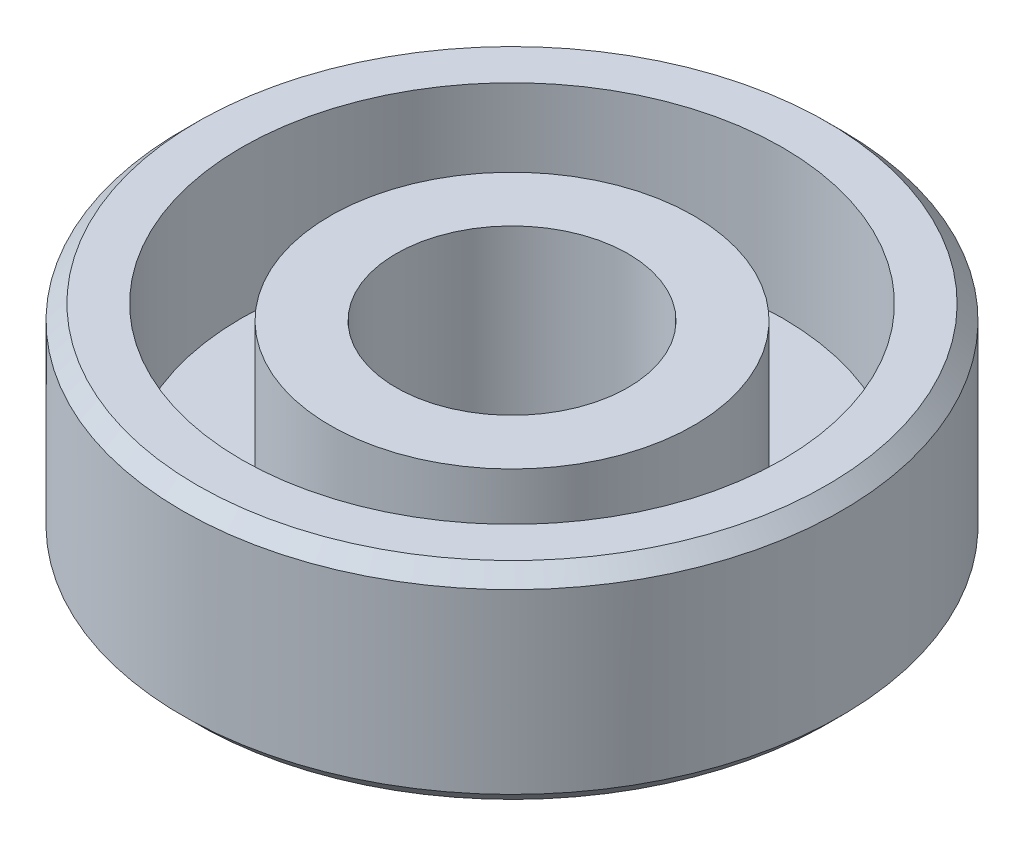
ISO-10303-21;
HEADER;
FILE_DESCRIPTION(('STEP AP214'),'2;1');
FILE_NAME('part.step','',(''),(''),'','','');
FILE_SCHEMA(('AUTOMOTIVE_DESIGN { 1 0 10303 214 1 1 1 1 }'));
ENDSEC;
DATA;
#1=APPLICATION_CONTEXT('core data for automotive mechanical design processes');
#2=APPLICATION_PROTOCOL_DEFINITION('international standard','automotive_design',2000,#1);
#3=PRODUCT_CONTEXT('',#1,'mechanical');
#4=PRODUCT('Part','Part','',(#3));
#5=PRODUCT_RELATED_PRODUCT_CATEGORY('part','',(#4));
#6=PRODUCT_DEFINITION_FORMATION('','',#4);
#7=PRODUCT_DEFINITION_CONTEXT('part definition',#1,'design');
#8=PRODUCT_DEFINITION('design','',#6,#7);
#9=PRODUCT_DEFINITION_SHAPE('','',#8);
#10=(LENGTH_UNIT() NAMED_UNIT(*) SI_UNIT(.MILLI.,.METRE.));
#11=(NAMED_UNIT(*) PLANE_ANGLE_UNIT() SI_UNIT($,.RADIAN.));
#12=(NAMED_UNIT(*) SI_UNIT($,.STERADIAN.) SOLID_ANGLE_UNIT());
#13=UNCERTAINTY_MEASURE_WITH_UNIT(LENGTH_MEASURE(1.E-05),#10,'distance_accuracy_value','');
#14=(GEOMETRIC_REPRESENTATION_CONTEXT(3) GLOBAL_UNCERTAINTY_ASSIGNED_CONTEXT((#13)) GLOBAL_UNIT_ASSIGNED_CONTEXT((#10,
#11,#12)) REPRESENTATION_CONTEXT('',''));
#15=CARTESIAN_POINT('',(0.,0.,0.));
#16=DIRECTION('',(0.,0.,1.));
#17=DIRECTION('',(1.,0.,0.));
#18=AXIS2_PLACEMENT_3D('',#15,#16,#17);
#19=CARTESIAN_POINT('',(0.,0.,0.));
#20=DIRECTION('',(0.,-1.,0.));
#21=DIRECTION('',(0.,0.,-1.));
#22=AXIS2_PLACEMENT_3D('',#19,#20,#21);
#23=CYLINDRICAL_SURFACE('',#22,3.925);
#24=CARTESIAN_POINT('',(0.,11.0925223970787,0.));
#25=DIRECTION('',(0.,-1.,0.));
#26=DIRECTION('',(0.,0.,-1.));
#27=AXIS2_PLACEMENT_3D('',#24,#25,#26);
#28=CIRCLE('',#27,3.925);
#29=CARTESIAN_POINT('',(0.,11.0925223970787,-3.925));
#30=VERTEX_POINT('',#29);
#31=EDGE_CURVE('E51',#30,#30,#28,.T.);
#32=ORIENTED_EDGE('',*,*,#31,.T.);
#33=EDGE_LOOP('',(#32));
#34=FACE_BOUND('',#33,.T.);
#35=CARTESIAN_POINT('',(0.,17.5925223970787,0.));
#36=DIRECTION('',(0.,-1.,0.));
#37=DIRECTION('',(0.,0.,-1.));
#38=AXIS2_PLACEMENT_3D('',#35,#36,#37);
#39=CIRCLE('',#38,3.925);
#40=CARTESIAN_POINT('',(0.,17.5925223970787,-3.925));
#41=VERTEX_POINT('',#40);
#42=EDGE_CURVE('E66',#41,#41,#39,.T.);
#43=ORIENTED_EDGE('',*,*,#42,.F.);
#44=EDGE_LOOP('',(#43));
#45=FACE_BOUND('',#44,.T.);
#46=ADVANCED_FACE('F31',(#34,#45),#23,.F.);
#47=CARTESIAN_POINT('',(9.66281728302333,11.0925223970787,0.));
#48=DIRECTION('',(0.,-1.,0.));
#49=DIRECTION('',(0.,0.,-1.));
#50=AXIS2_PLACEMENT_3D('',#47,#48,#49);
#51=PLANE('',#50);
#52=CARTESIAN_POINT('',(0.,11.0925223970787,0.));
#53=DIRECTION('',(0.,-1.,0.));
#54=DIRECTION('',(0.,0.,-1.));
#55=AXIS2_PLACEMENT_3D('',#52,#53,#54);
#56=CIRCLE('',#55,10.65);
#57=CARTESIAN_POINT('',(0.,11.0925223970787,-10.65));
#58=VERTEX_POINT('',#57);
#59=EDGE_CURVE('E46',#58,#58,#56,.T.);
#60=ORIENTED_EDGE('',*,*,#59,.T.);
#61=EDGE_LOOP('',(#60));
#62=FACE_BOUND('',#61,.T.);
#63=ORIENTED_EDGE('',*,*,#31,.F.);
#64=EDGE_LOOP('',(#63));
#65=FACE_BOUND('',#64,.T.);
#66=ADVANCED_FACE('F74',(#62,#65),#51,.T.);
#67=CARTESIAN_POINT('',(0.,0.,0.));
#68=DIRECTION('',(0.,-1.,0.));
#69=DIRECTION('',(0.,0.,-1.));
#70=AXIS2_PLACEMENT_3D('',#67,#68,#69);
#71=CYLINDRICAL_SURFACE('',#70,11.15);
#72=CARTESIAN_POINT('',(0.,11.5925223970787,0.));
#73=DIRECTION('',(0.,-1.,0.));
#74=DIRECTION('',(0.,0.,-1.));
#75=AXIS2_PLACEMENT_3D('',#72,#73,#74);
#76=CIRCLE('',#75,11.15);
#77=CARTESIAN_POINT('',(0.,11.5925223970787,-11.15));
#78=VERTEX_POINT('',#77);
#79=EDGE_CURVE('E38',#78,#78,#76,.F.);
#80=ORIENTED_EDGE('',*,*,#79,.T.);
#81=EDGE_LOOP('',(#80));
#82=FACE_BOUND('',#81,.T.);
#83=CARTESIAN_POINT('',(0.,17.5925223970787,0.));
#84=DIRECTION('',(0.,1.,0.));
#85=DIRECTION('',(0.,0.,1.));
#86=AXIS2_PLACEMENT_3D('',#83,#84,#85);
#87=CIRCLE('',#86,11.15);
#88=CARTESIAN_POINT('',(0.,17.5925223970787,11.15));
#89=VERTEX_POINT('',#88);
#90=EDGE_CURVE('E42',#89,#89,#87,.F.);
#91=ORIENTED_EDGE('',*,*,#90,.T.);
#92=EDGE_LOOP('',(#91));
#93=FACE_BOUND('',#92,.T.);
#94=ADVANCED_FACE('F80',(#82,#93),#71,.T.);
#95=CARTESIAN_POINT('',(9.15,18.0925223970787,0.));
#96=DIRECTION('',(0.,1.,0.));
#97=DIRECTION('',(0.,0.,1.));
#98=AXIS2_PLACEMENT_3D('',#95,#96,#97);
#99=PLANE('',#98);
#100=CARTESIAN_POINT('',(0.,18.0925223970787,0.));
#101=DIRECTION('',(0.,1.,0.));
#102=DIRECTION('',(0.,0.,1.));
#103=AXIS2_PLACEMENT_3D('',#100,#101,#102);
#104=CIRCLE('',#103,10.65);
#105=CARTESIAN_POINT('',(0.,18.0925223970787,10.65));
#106=VERTEX_POINT('',#105);
#107=EDGE_CURVE('E10',#106,#106,#104,.T.);
#108=ORIENTED_EDGE('',*,*,#107,.T.);
#109=EDGE_LOOP('',(#108));
#110=FACE_BOUND('',#109,.T.);
#111=CARTESIAN_POINT('',(0.,18.0925223970787,0.));
#112=DIRECTION('',(0.,-1.,0.));
#113=DIRECTION('',(0.,0.,-1.));
#114=AXIS2_PLACEMENT_3D('',#111,#112,#113);
#115=CIRCLE('',#114,9.15);
#116=CARTESIAN_POINT('',(0.,18.0925223970787,-9.15));
#117=VERTEX_POINT('',#116);
#118=EDGE_CURVE('E54',#117,#117,#115,.T.);
#119=ORIENTED_EDGE('',*,*,#118,.T.);
#120=EDGE_LOOP('',(#119));
#121=FACE_BOUND('',#120,.T.);
#122=ADVANCED_FACE('F111',(#110,#121),#99,.T.);
#123=CARTESIAN_POINT('',(0.,0.,0.));
#124=DIRECTION('',(0.,-1.,0.));
#125=DIRECTION('',(0.,0.,-1.));
#126=AXIS2_PLACEMENT_3D('',#123,#124,#125);
#127=CYLINDRICAL_SURFACE('',#126,9.15);
#128=CARTESIAN_POINT('',(0.,13.0925223970787,0.));
#129=DIRECTION('',(0.,-1.,0.));
#130=DIRECTION('',(0.,0.,-1.));
#131=AXIS2_PLACEMENT_3D('',#128,#129,#130);
#132=CIRCLE('',#131,9.15);
#133=CARTESIAN_POINT('',(0.,13.0925223970787,-9.15));
#134=VERTEX_POINT('',#133);
#135=EDGE_CURVE('E57',#134,#134,#132,.T.);
#136=ORIENTED_EDGE('',*,*,#135,.T.);
#137=EDGE_LOOP('',(#136));
#138=FACE_BOUND('',#137,.T.);
#139=ORIENTED_EDGE('',*,*,#118,.F.);
#140=EDGE_LOOP('',(#139));
#141=FACE_BOUND('',#140,.T.);
#142=ADVANCED_FACE('F107',(#138,#141),#127,.F.);
#143=CARTESIAN_POINT('',(6.15,13.0925223970787,0.));
#144=DIRECTION('',(0.,1.,0.));
#145=DIRECTION('',(0.,0.,1.));
#146=AXIS2_PLACEMENT_3D('',#143,#144,#145);
#147=PLANE('',#146);
#148=CARTESIAN_POINT('',(0.,13.0925223970787,0.));
#149=DIRECTION('',(0.,-1.,0.));
#150=DIRECTION('',(0.,0.,-1.));
#151=AXIS2_PLACEMENT_3D('',#148,#149,#150);
#152=CIRCLE('',#151,6.15);
#153=CARTESIAN_POINT('',(0.,13.0925223970787,-6.15));
#154=VERTEX_POINT('',#153);
#155=EDGE_CURVE('E60',#154,#154,#152,.T.);
#156=ORIENTED_EDGE('',*,*,#155,.T.);
#157=EDGE_LOOP('',(#156));
#158=FACE_BOUND('',#157,.T.);
#159=ORIENTED_EDGE('',*,*,#135,.F.);
#160=EDGE_LOOP('',(#159));
#161=FACE_BOUND('',#160,.T.);
#162=ADVANCED_FACE('F101',(#158,#161),#147,.T.);
#163=CARTESIAN_POINT('',(0.,0.,0.));
#164=DIRECTION('',(0.,-1.,0.));
#165=DIRECTION('',(0.,0.,-1.));
#166=AXIS2_PLACEMENT_3D('',#163,#164,#165);
#167=CYLINDRICAL_SURFACE('',#166,6.15);
#168=CARTESIAN_POINT('',(0.,17.5925223970787,0.));
#169=DIRECTION('',(0.,-1.,0.));
#170=DIRECTION('',(0.,0.,-1.));
#171=AXIS2_PLACEMENT_3D('',#168,#169,#170);
#172=CIRCLE('',#171,6.15);
#173=CARTESIAN_POINT('',(0.,17.5925223970787,-6.15));
#174=VERTEX_POINT('',#173);
#175=EDGE_CURVE('E63',#174,#174,#172,.T.);
#176=ORIENTED_EDGE('',*,*,#175,.T.);
#177=EDGE_LOOP('',(#176));
#178=FACE_BOUND('',#177,.T.);
#179=ORIENTED_EDGE('',*,*,#155,.F.);
#180=EDGE_LOOP('',(#179));
#181=FACE_BOUND('',#180,.T.);
#182=ADVANCED_FACE('F92',(#178,#181),#167,.T.);
#183=CARTESIAN_POINT('',(3.925,17.5925223970787,0.));
#184=DIRECTION('',(0.,1.,0.));
#185=DIRECTION('',(0.,0.,1.));
#186=AXIS2_PLACEMENT_3D('',#183,#184,#185);
#187=PLANE('',#186);
#188=ORIENTED_EDGE('',*,*,#42,.T.);
#189=EDGE_LOOP('',(#188));
#190=FACE_BOUND('',#189,.T.);
#191=ORIENTED_EDGE('',*,*,#175,.F.);
#192=EDGE_LOOP('',(#191));
#193=FACE_BOUND('',#192,.T.);
#194=ADVANCED_FACE('F70',(#190,#193),#187,.T.);
#195=CARTESIAN_POINT('',(0.,11.0925223970787,0.));
#196=DIRECTION('',(0.,1.,0.));
#197=DIRECTION('',(0.,0.,1.));
#198=AXIS2_PLACEMENT_3D('',#195,#196,#197);
#199=CONICAL_SURFACE('',#198,10.65,0.785398163397448);
#200=ORIENTED_EDGE('',*,*,#79,.F.);
#201=EDGE_LOOP('',(#200));
#202=FACE_BOUND('',#201,.T.);
#203=ORIENTED_EDGE('',*,*,#59,.F.);
#204=EDGE_LOOP('',(#203));
#205=FACE_BOUND('',#204,.T.);
#206=ADVANCED_FACE('F84',(#202,#205),#199,.T.);
#207=CARTESIAN_POINT('',(0.,17.5925223970787,0.));
#208=DIRECTION('',(0.,-1.,0.));
#209=DIRECTION('',(0.,0.,-1.));
#210=AXIS2_PLACEMENT_3D('',#207,#208,#209);
#211=CONICAL_SURFACE('',#210,11.15,0.785398163397454);
#212=ORIENTED_EDGE('',*,*,#107,.F.);
#213=EDGE_LOOP('',(#212));
#214=FACE_BOUND('',#213,.T.);
#215=ORIENTED_EDGE('',*,*,#90,.F.);
#216=EDGE_LOOP('',(#215));
#217=FACE_BOUND('',#216,.T.);
#218=ADVANCED_FACE('F33',(#214,#217),#211,.T.);
#219=CLOSED_SHELL('',(#46,#66,#94,#122,#142,#162,#182,#194,#206,#218));
#220=MANIFOLD_SOLID_BREP('B2',#219);
#221=ADVANCED_BREP_SHAPE_REPRESENTATION('',(#18,#220),#14);
#222=SHAPE_DEFINITION_REPRESENTATION(#9,#221);
ENDSEC;
END-ISO-10303-21;
